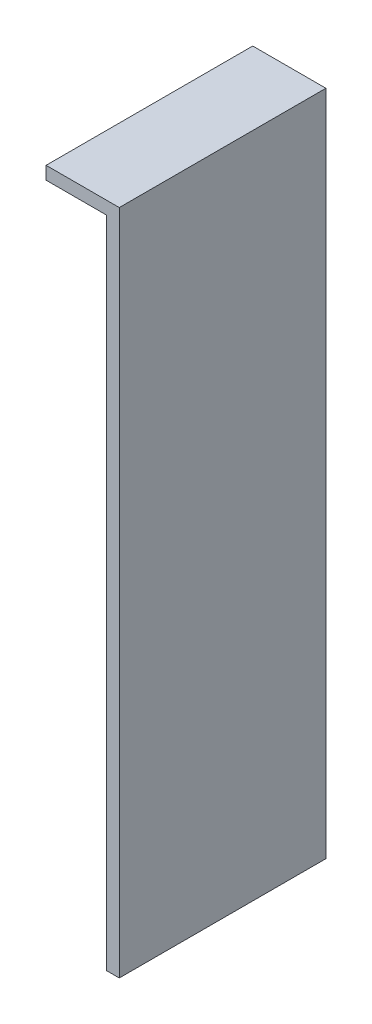
ISO-10303-21;
HEADER;
FILE_DESCRIPTION(('STEP AP214'),'2;1');
FILE_NAME('part.step','',(''),(''),'','','');
FILE_SCHEMA(('AUTOMOTIVE_DESIGN { 1 0 10303 214 1 1 1 1 }'));
ENDSEC;
DATA;
#1=APPLICATION_CONTEXT('core data for automotive mechanical design processes');
#2=APPLICATION_PROTOCOL_DEFINITION('international standard','automotive_design',2000,#1);
#3=PRODUCT_CONTEXT('',#1,'mechanical');
#4=PRODUCT('Part','Part','',(#3));
#5=PRODUCT_RELATED_PRODUCT_CATEGORY('part','',(#4));
#6=PRODUCT_DEFINITION_FORMATION('','',#4);
#7=PRODUCT_DEFINITION_CONTEXT('part definition',#1,'design');
#8=PRODUCT_DEFINITION('design','',#6,#7);
#9=PRODUCT_DEFINITION_SHAPE('','',#8);
#10=(LENGTH_UNIT() NAMED_UNIT(*) SI_UNIT(.MILLI.,.METRE.));
#11=(NAMED_UNIT(*) PLANE_ANGLE_UNIT() SI_UNIT($,.RADIAN.));
#12=(NAMED_UNIT(*) SI_UNIT($,.STERADIAN.) SOLID_ANGLE_UNIT());
#13=UNCERTAINTY_MEASURE_WITH_UNIT(LENGTH_MEASURE(1.E-05),#10,'distance_accuracy_value','');
#14=(GEOMETRIC_REPRESENTATION_CONTEXT(3) GLOBAL_UNCERTAINTY_ASSIGNED_CONTEXT((#13)) GLOBAL_UNIT_ASSIGNED_CONTEXT((#10,
#11,#12)) REPRESENTATION_CONTEXT('',''));
#15=CARTESIAN_POINT('',(0.,0.,0.));
#16=DIRECTION('',(0.,0.,1.));
#17=DIRECTION('',(1.,0.,0.));
#18=AXIS2_PLACEMENT_3D('',#15,#16,#17);
#19=CARTESIAN_POINT('',(-2.125,19.375,12.));
#20=DIRECTION('',(1.,0.,0.));
#21=DIRECTION('',(0.,0.,-1.));
#22=AXIS2_PLACEMENT_3D('',#19,#20,#21);
#23=PLANE('',#22);
#24=DIRECTION('',(0.,0.,-1.));
#25=VECTOR('',#24,1.);
#26=CARTESIAN_POINT('',(-2.125,-19.375,12.));
#27=LINE('',#26,#25);
#28=CARTESIAN_POINT('',(-2.125,-19.375,2.25));
#29=VERTEX_POINT('',#28);
#30=CARTESIAN_POINT('',(-2.125,-19.375,0.));
#31=VERTEX_POINT('',#30);
#32=EDGE_CURVE('E11',#29,#31,#27,.T.);
#33=ORIENTED_EDGE('',*,*,#32,.F.);
#34=DIRECTION('',(0.,-1.,0.));
#35=VECTOR('',#34,1.);
#36=CARTESIAN_POINT('',(-2.125,-19.375,2.25));
#37=LINE('',#36,#35);
#38=CARTESIAN_POINT('',(-2.125,18.625,2.25));
#39=VERTEX_POINT('',#38);
#40=EDGE_CURVE('E116',#39,#29,#37,.T.);
#41=ORIENTED_EDGE('',*,*,#40,.F.);
#42=DIRECTION('',(0.,0.,-1.));
#43=VECTOR('',#42,1.);
#44=CARTESIAN_POINT('',(-2.125,18.625,12.));
#45=LINE('',#44,#43);
#46=CARTESIAN_POINT('',(-2.125,18.625,12.));
#47=VERTEX_POINT('',#46);
#48=EDGE_CURVE('E178',#47,#39,#45,.T.);
#49=ORIENTED_EDGE('',*,*,#48,.F.);
#50=DIRECTION('',(0.,-1.,0.));
#51=VECTOR('',#50,1.);
#52=CARTESIAN_POINT('',(-2.125,19.375,12.));
#53=LINE('',#52,#51);
#54=CARTESIAN_POINT('',(-2.125,19.375,12.));
#55=VERTEX_POINT('',#54);
#56=EDGE_CURVE('E120',#55,#47,#53,.T.);
#57=ORIENTED_EDGE('',*,*,#56,.F.);
#58=DIRECTION('',(0.,0.,-1.));
#59=VECTOR('',#58,1.);
#60=CARTESIAN_POINT('',(-2.125,19.375,12.));
#61=LINE('',#60,#59);
#62=CARTESIAN_POINT('',(-2.125,19.375,0.));
#63=VERTEX_POINT('',#62);
#64=EDGE_CURVE('E132',#55,#63,#61,.T.);
#65=ORIENTED_EDGE('',*,*,#64,.T.);
#66=DIRECTION('',(0.,-1.,0.));
#67=VECTOR('',#66,1.);
#68=CARTESIAN_POINT('',(-2.125,19.375,0.));
#69=LINE('',#68,#67);
#70=EDGE_CURVE('E133',#63,#31,#69,.T.);
#71=ORIENTED_EDGE('',*,*,#70,.T.);
#72=EDGE_LOOP('',(#33,#41,#49,#57,#65,#71));
#73=FACE_BOUND('',#72,.T.);
#74=ADVANCED_FACE('F37',(#73),#23,.F.);
#75=CARTESIAN_POINT('',(-2.125,-19.375,12.));
#76=DIRECTION('',(0.,1.,0.));
#77=DIRECTION('',(0.,0.,1.));
#78=AXIS2_PLACEMENT_3D('',#75,#76,#77);
#79=PLANE('',#78);
#80=DIRECTION('',(0.,0.,1.));
#81=VECTOR('',#80,1.);
#82=CARTESIAN_POINT('',(1.375,-19.375,12.));
#83=LINE('',#82,#81);
#84=CARTESIAN_POINT('',(1.375,-19.375,2.25));
#85=VERTEX_POINT('',#84);
#86=CARTESIAN_POINT('',(1.375,-19.375,12.));
#87=VERTEX_POINT('',#86);
#88=EDGE_CURVE('E51',#85,#87,#83,.T.);
#89=ORIENTED_EDGE('',*,*,#88,.F.);
#90=DIRECTION('',(-1.,0.,0.));
#91=VECTOR('',#90,1.);
#92=CARTESIAN_POINT('',(1.375,-19.375,2.25));
#93=LINE('',#92,#91);
#94=EDGE_CURVE('E122',#85,#29,#93,.T.);
#95=ORIENTED_EDGE('',*,*,#94,.T.);
#96=ORIENTED_EDGE('',*,*,#32,.T.);
#97=DIRECTION('',(1.,0.,0.));
#98=VECTOR('',#97,1.);
#99=CARTESIAN_POINT('',(-2.125,-19.375,0.));
#100=LINE('',#99,#98);
#101=CARTESIAN_POINT('',(2.125,-19.375,0.));
#102=VERTEX_POINT('',#101);
#103=EDGE_CURVE('E136',#31,#102,#100,.T.);
#104=ORIENTED_EDGE('',*,*,#103,.T.);
#105=DIRECTION('',(0.,0.,-1.));
#106=VECTOR('',#105,1.);
#107=CARTESIAN_POINT('',(2.125,-19.375,12.));
#108=LINE('',#107,#106);
#109=CARTESIAN_POINT('',(2.125,-19.375,12.));
#110=VERTEX_POINT('',#109);
#111=EDGE_CURVE('E44',#110,#102,#108,.T.);
#112=ORIENTED_EDGE('',*,*,#111,.F.);
#113=DIRECTION('',(1.,0.,0.));
#114=VECTOR('',#113,1.);
#115=CARTESIAN_POINT('',(-2.125,-19.375,12.));
#116=LINE('',#115,#114);
#117=EDGE_CURVE('E83',#87,#110,#116,.T.);
#118=ORIENTED_EDGE('',*,*,#117,.F.);
#119=EDGE_LOOP('',(#89,#95,#96,#104,#112,#118));
#120=FACE_BOUND('',#119,.T.);
#121=ADVANCED_FACE('F165',(#120),#79,.F.);
#122=CARTESIAN_POINT('',(2.125,19.375,12.));
#123=DIRECTION('',(-1.,0.,0.));
#124=DIRECTION('',(0.,-1.,0.));
#125=AXIS2_PLACEMENT_3D('',#122,#123,#124);
#126=PLANE('',#125);
#127=DIRECTION('',(0.,1.,0.));
#128=VECTOR('',#127,1.);
#129=CARTESIAN_POINT('',(2.125,19.375,0.));
#130=LINE('',#129,#128);
#131=CARTESIAN_POINT('',(2.125,19.375,0.));
#132=VERTEX_POINT('',#131);
#133=EDGE_CURVE('E138',#102,#132,#130,.T.);
#134=ORIENTED_EDGE('',*,*,#133,.T.);
#135=DIRECTION('',(0.,0.,-1.));
#136=VECTOR('',#135,1.);
#137=CARTESIAN_POINT('',(2.125,19.375,12.));
#138=LINE('',#137,#136);
#139=CARTESIAN_POINT('',(2.125,19.375,12.));
#140=VERTEX_POINT('',#139);
#141=EDGE_CURVE('E142',#140,#132,#138,.T.);
#142=ORIENTED_EDGE('',*,*,#141,.F.);
#143=DIRECTION('',(0.,1.,0.));
#144=VECTOR('',#143,1.);
#145=CARTESIAN_POINT('',(2.125,19.375,12.));
#146=LINE('',#145,#144);
#147=EDGE_CURVE('E129',#110,#140,#146,.T.);
#148=ORIENTED_EDGE('',*,*,#147,.F.);
#149=ORIENTED_EDGE('',*,*,#111,.T.);
#150=EDGE_LOOP('',(#134,#142,#148,#149));
#151=FACE_BOUND('',#150,.T.);
#152=ADVANCED_FACE('F147',(#151),#126,.F.);
#153=CARTESIAN_POINT('',(-2.125,19.375,12.));
#154=DIRECTION('',(0.,-1.,0.));
#155=DIRECTION('',(0.,0.,-1.));
#156=AXIS2_PLACEMENT_3D('',#153,#154,#155);
#157=PLANE('',#156);
#158=DIRECTION('',(-1.,0.,0.));
#159=VECTOR('',#158,1.);
#160=CARTESIAN_POINT('',(-2.125,19.375,0.));
#161=LINE('',#160,#159);
#162=EDGE_CURVE('E79',#132,#63,#161,.T.);
#163=ORIENTED_EDGE('',*,*,#162,.T.);
#164=ORIENTED_EDGE('',*,*,#64,.F.);
#165=DIRECTION('',(-1.,0.,0.));
#166=VECTOR('',#165,1.);
#167=CARTESIAN_POINT('',(-2.125,19.375,12.));
#168=LINE('',#167,#166);
#169=EDGE_CURVE('E60',#140,#55,#168,.T.);
#170=ORIENTED_EDGE('',*,*,#169,.F.);
#171=ORIENTED_EDGE('',*,*,#141,.T.);
#172=EDGE_LOOP('',(#163,#164,#170,#171));
#173=FACE_BOUND('',#172,.T.);
#174=ADVANCED_FACE('F157',(#173),#157,.F.);
#175=CARTESIAN_POINT('',(0.,0.,12.));
#176=DIRECTION('',(0.,0.,1.));
#177=DIRECTION('',(1.,0.,0.));
#178=AXIS2_PLACEMENT_3D('',#175,#176,#177);
#179=PLANE('',#178);
#180=DIRECTION('',(-1.,0.,0.));
#181=VECTOR('',#180,1.);
#182=CARTESIAN_POINT('',(1.375,18.625,12.));
#183=LINE('',#182,#181);
#184=CARTESIAN_POINT('',(1.375,18.625,12.));
#185=VERTEX_POINT('',#184);
#186=EDGE_CURVE('E108',#185,#47,#183,.T.);
#187=ORIENTED_EDGE('',*,*,#186,.F.);
#188=DIRECTION('',(0.,1.,0.));
#189=VECTOR('',#188,1.);
#190=CARTESIAN_POINT('',(1.375,-19.375,12.));
#191=LINE('',#190,#189);
#192=EDGE_CURVE('E113',#87,#185,#191,.T.);
#193=ORIENTED_EDGE('',*,*,#192,.F.);
#194=ORIENTED_EDGE('',*,*,#117,.T.);
#195=ORIENTED_EDGE('',*,*,#147,.T.);
#196=ORIENTED_EDGE('',*,*,#169,.T.);
#197=ORIENTED_EDGE('',*,*,#56,.T.);
#198=EDGE_LOOP('',(#187,#193,#194,#195,#196,#197));
#199=FACE_BOUND('',#198,.T.);
#200=ADVANCED_FACE('F118',(#199),#179,.T.);
#201=CARTESIAN_POINT('',(0.,0.,0.));
#202=DIRECTION('',(0.,0.,1.));
#203=DIRECTION('',(1.,0.,0.));
#204=AXIS2_PLACEMENT_3D('',#201,#202,#203);
#205=PLANE('',#204);
#206=ORIENTED_EDGE('',*,*,#70,.F.);
#207=ORIENTED_EDGE('',*,*,#162,.F.);
#208=ORIENTED_EDGE('',*,*,#133,.F.);
#209=ORIENTED_EDGE('',*,*,#103,.F.);
#210=EDGE_LOOP('',(#206,#207,#208,#209));
#211=FACE_BOUND('',#210,.T.);
#212=ADVANCED_FACE('F153',(#211),#205,.F.);
#213=CARTESIAN_POINT('',(1.375,-19.375,2.25));
#214=DIRECTION('',(0.,0.,-1.));
#215=DIRECTION('',(-1.,0.,0.));
#216=AXIS2_PLACEMENT_3D('',#213,#214,#215);
#217=PLANE('',#216);
#218=ORIENTED_EDGE('',*,*,#40,.T.);
#219=ORIENTED_EDGE('',*,*,#94,.F.);
#220=DIRECTION('',(0.,-1.,0.));
#221=VECTOR('',#220,1.);
#222=CARTESIAN_POINT('',(1.375,-19.375,2.25));
#223=LINE('',#222,#221);
#224=CARTESIAN_POINT('',(1.375,18.625,2.25));
#225=VERTEX_POINT('',#224);
#226=EDGE_CURVE('E112',#225,#85,#223,.T.);
#227=ORIENTED_EDGE('',*,*,#226,.F.);
#228=DIRECTION('',(-1.,0.,0.));
#229=VECTOR('',#228,1.);
#230=CARTESIAN_POINT('',(1.375,18.625,2.25));
#231=LINE('',#230,#229);
#232=EDGE_CURVE('E110',#225,#39,#231,.T.);
#233=ORIENTED_EDGE('',*,*,#232,.T.);
#234=EDGE_LOOP('',(#218,#219,#227,#233));
#235=FACE_BOUND('',#234,.T.);
#236=ADVANCED_FACE('F180',(#235),#217,.F.);
#237=CARTESIAN_POINT('',(1.375,18.625,12.));
#238=DIRECTION('',(0.,1.,0.));
#239=DIRECTION('',(0.,0.,1.));
#240=AXIS2_PLACEMENT_3D('',#237,#238,#239);
#241=PLANE('',#240);
#242=ORIENTED_EDGE('',*,*,#48,.T.);
#243=ORIENTED_EDGE('',*,*,#232,.F.);
#244=DIRECTION('',(0.,0.,-1.));
#245=VECTOR('',#244,1.);
#246=CARTESIAN_POINT('',(1.375,18.625,12.));
#247=LINE('',#246,#245);
#248=EDGE_CURVE('E104',#185,#225,#247,.T.);
#249=ORIENTED_EDGE('',*,*,#248,.F.);
#250=ORIENTED_EDGE('',*,*,#186,.T.);
#251=EDGE_LOOP('',(#242,#243,#249,#250));
#252=FACE_BOUND('',#251,.T.);
#253=ADVANCED_FACE('F106',(#252),#241,.F.);
#254=CARTESIAN_POINT('',(1.375,0.,0.));
#255=DIRECTION('',(-1.,0.,0.));
#256=DIRECTION('',(0.,0.,1.));
#257=AXIS2_PLACEMENT_3D('',#254,#255,#256);
#258=PLANE('',#257);
#259=ORIENTED_EDGE('',*,*,#192,.T.);
#260=ORIENTED_EDGE('',*,*,#248,.T.);
#261=ORIENTED_EDGE('',*,*,#226,.T.);
#262=ORIENTED_EDGE('',*,*,#88,.T.);
#263=EDGE_LOOP('',(#259,#260,#261,#262));
#264=FACE_BOUND('',#263,.T.);
#265=ADVANCED_FACE('F115',(#264),#258,.T.);
#266=CLOSED_SHELL('',(#74,#121,#152,#174,#200,#212,#236,#253,#265));
#267=MANIFOLD_SOLID_BREP('B2',#266);
#268=ADVANCED_BREP_SHAPE_REPRESENTATION('',(#18,#267),#14);
#269=SHAPE_DEFINITION_REPRESENTATION(#9,#268);
ENDSEC;
END-ISO-10303-21;
